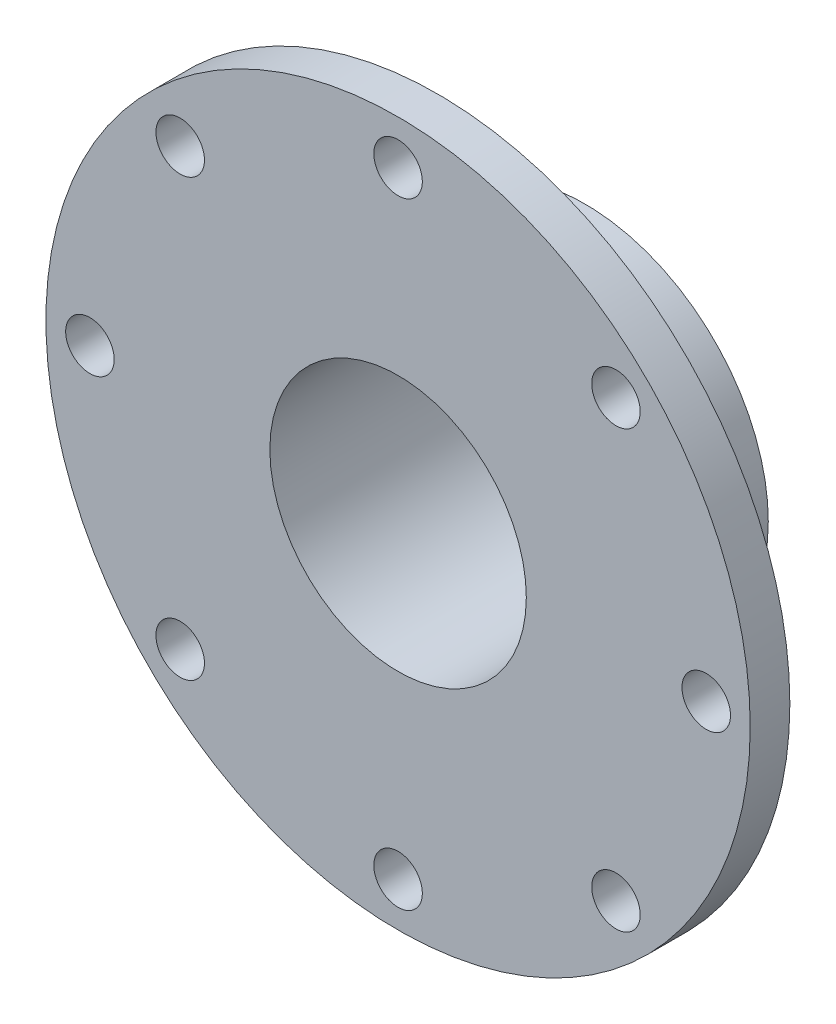
ISO-10303-21;
HEADER;
FILE_DESCRIPTION(('STEP AP214'),'2;1');
FILE_NAME('part.step','',(''),(''),'','','');
FILE_SCHEMA(('AUTOMOTIVE_DESIGN { 1 0 10303 214 1 1 1 1 }'));
ENDSEC;
DATA;
#1=APPLICATION_CONTEXT('core data for automotive mechanical design processes');
#2=APPLICATION_PROTOCOL_DEFINITION('international standard','automotive_design',2000,#1);
#3=PRODUCT_CONTEXT('',#1,'mechanical');
#4=PRODUCT('Part','Part','',(#3));
#5=PRODUCT_RELATED_PRODUCT_CATEGORY('part','',(#4));
#6=PRODUCT_DEFINITION_FORMATION('','',#4);
#7=PRODUCT_DEFINITION_CONTEXT('part definition',#1,'design');
#8=PRODUCT_DEFINITION('design','',#6,#7);
#9=PRODUCT_DEFINITION_SHAPE('','',#8);
#10=(LENGTH_UNIT() NAMED_UNIT(*) SI_UNIT(.MILLI.,.METRE.));
#11=(NAMED_UNIT(*) PLANE_ANGLE_UNIT() SI_UNIT($,.RADIAN.));
#12=(NAMED_UNIT(*) SI_UNIT($,.STERADIAN.) SOLID_ANGLE_UNIT());
#13=UNCERTAINTY_MEASURE_WITH_UNIT(LENGTH_MEASURE(1.E-05),#10,'distance_accuracy_value','');
#14=(GEOMETRIC_REPRESENTATION_CONTEXT(3) GLOBAL_UNCERTAINTY_ASSIGNED_CONTEXT((#13)) GLOBAL_UNIT_ASSIGNED_CONTEXT((#10,
#11,#12)) REPRESENTATION_CONTEXT('',''));
#15=CARTESIAN_POINT('',(0.,0.,0.));
#16=DIRECTION('',(0.,0.,1.));
#17=DIRECTION('',(1.,0.,0.));
#18=AXIS2_PLACEMENT_3D('',#15,#16,#17);
#19=CARTESIAN_POINT('',(0.,26.4566400001054,36.195));
#20=DIRECTION('',(0.,0.,1.));
#21=DIRECTION('',(1.,0.,0.));
#22=AXIS2_PLACEMENT_3D('',#19,#20,#21);
#23=PLANE('',#22);
#24=CARTESIAN_POINT('',(0.,0.,36.195));
#25=DIRECTION('',(0.,0.,1.));
#26=DIRECTION('',(1.,0.,0.));
#27=AXIS2_PLACEMENT_3D('',#24,#25,#26);
#28=CIRCLE('',#27,26.4566400001054);
#29=CARTESIAN_POINT('',(26.4566400001054,0.,36.195));
#30=VERTEX_POINT('',#29);
#31=EDGE_CURVE('E11',#30,#30,#28,.T.);
#32=ORIENTED_EDGE('',*,*,#31,.T.);
#33=EDGE_LOOP('',(#32));
#34=FACE_BOUND('',#33,.T.);
#35=CARTESIAN_POINT('',(0.,0.,36.195));
#36=DIRECTION('',(0.,0.,-1.));
#37=DIRECTION('',(-1.,0.,0.));
#38=AXIS2_PLACEMENT_3D('',#35,#36,#37);
#39=CIRCLE('',#38,35.433);
#40=CARTESIAN_POINT('',(-35.433,0.,36.195));
#41=VERTEX_POINT('',#40);
#42=EDGE_CURVE('E277',#41,#41,#39,.T.);
#43=ORIENTED_EDGE('',*,*,#42,.T.);
#44=EDGE_LOOP('',(#43));
#45=FACE_BOUND('',#44,.T.);
#46=ADVANCED_FACE('F51',(#34,#45),#23,.F.);
#47=CARTESIAN_POINT('',(0.,0.,11.925039552395));
#48=DIRECTION('',(0.,0.,1.));
#49=DIRECTION('',(1.,0.,0.));
#50=AXIS2_PLACEMENT_3D('',#47,#48,#49);
#51=CYLINDRICAL_SURFACE('',#50,26.4566400001054);
#52=ORIENTED_EDGE('',*,*,#31,.F.);
#53=EDGE_LOOP('',(#52));
#54=FACE_BOUND('',#53,.T.);
#55=CARTESIAN_POINT('',(1.97758476261356E-13,-1.78676518025611E-13,14.96296947888));
#56=DIRECTION('',(0.,0.,1.));
#57=DIRECTION('',(1.,0.,0.));
#58=AXIS2_PLACEMENT_3D('',#55,#56,#57);
#59=CIRCLE('',#58,26.4566400001056);
#60=CARTESIAN_POINT('',(17.7258483540588,19.6404709776552,14.96296947888));
#61=VERTEX_POINT('',#60);
#62=CARTESIAN_POINT('',(-17.725848354048,-19.640470977648,14.96296947888));
#63=VERTEX_POINT('',#62);
#64=EDGE_CURVE('E60',#61,#63,#59,.T.);
#65=ORIENTED_EDGE('',*,*,#64,.T.);
#66=CARTESIAN_POINT('',(1.18481613409216E-12,-1.07032438467769E-12,14.96296947888));
#67=DIRECTION('',(0.,0.,1.));
#68=DIRECTION('',(1.,0.,0.));
#69=AXIS2_PLACEMENT_3D('',#66,#67,#68);
#70=CIRCLE('',#69,26.4566400001056);
#71=EDGE_CURVE('E70',#63,#61,#70,.T.);
#72=ORIENTED_EDGE('',*,*,#71,.T.);
#73=EDGE_LOOP('',(#65,#72));
#74=FACE_BOUND('',#73,.T.);
#75=ADVANCED_FACE('F53',(#54,#74),#51,.T.);
#76=CARTESIAN_POINT('',(0.,0.,36.195));
#77=DIRECTION('',(0.,0.,-1.));
#78=DIRECTION('',(-1.,0.,0.));
#79=AXIS2_PLACEMENT_3D('',#76,#77,#78);
#80=CIRCLE('',#79,38.1508);
#81=CARTESIAN_POINT('',(-38.1508,0.,36.195));
#82=VERTEX_POINT('',#81);
#83=EDGE_CURVE('E271',#82,#82,#80,.T.);
#84=ORIENTED_EDGE('',*,*,#83,.F.);
#85=EDGE_LOOP('',(#84));
#86=FACE_BOUND('',#85,.T.);
#87=CARTESIAN_POINT('',(-31.430896423742,-31.430896423742,36.195));
#88=DIRECTION('',(0.,0.,1.));
#89=DIRECTION('',(1.,0.,0.));
#90=AXIS2_PLACEMENT_3D('',#87,#88,#89);
#91=CIRCLE('',#90,3.49999999999999);
#92=CARTESIAN_POINT('',(-27.930896423742,-31.430896423742,36.195));
#93=VERTEX_POINT('',#92);
#94=EDGE_CURVE('E206',#93,#93,#91,.F.);
#95=ORIENTED_EDGE('',*,*,#94,.F.);
#96=EDGE_LOOP('',(#95));
#97=FACE_BOUND('',#96,.T.);
#98=CARTESIAN_POINT('',(31.430896423742,-31.430896423742,36.195));
#99=DIRECTION('',(0.,0.,1.));
#100=DIRECTION('',(1.,0.,0.));
#101=AXIS2_PLACEMENT_3D('',#98,#99,#100);
#102=CIRCLE('',#101,3.49999999999999);
#103=CARTESIAN_POINT('',(34.930896423742,-31.430896423742,36.195));
#104=VERTEX_POINT('',#103);
#105=EDGE_CURVE('E211',#104,#104,#102,.F.);
#106=ORIENTED_EDGE('',*,*,#105,.F.);
#107=EDGE_LOOP('',(#106));
#108=FACE_BOUND('',#107,.T.);
#109=CARTESIAN_POINT('',(31.430896423742,31.430896423742,36.195));
#110=DIRECTION('',(0.,0.,1.));
#111=DIRECTION('',(1.,0.,0.));
#112=AXIS2_PLACEMENT_3D('',#109,#110,#111);
#113=CIRCLE('',#112,3.49999999999999);
#114=CARTESIAN_POINT('',(34.930896423742,31.430896423742,36.195));
#115=VERTEX_POINT('',#114);
#116=EDGE_CURVE('E219',#115,#115,#113,.F.);
#117=ORIENTED_EDGE('',*,*,#116,.F.);
#118=EDGE_LOOP('',(#117));
#119=FACE_BOUND('',#118,.T.);
#120=CARTESIAN_POINT('',(-31.430896423742,31.430896423742,36.195));
#121=DIRECTION('',(0.,0.,1.));
#122=DIRECTION('',(1.,0.,0.));
#123=AXIS2_PLACEMENT_3D('',#120,#121,#122);
#124=CIRCLE('',#123,3.49999999999999);
#125=CARTESIAN_POINT('',(-27.930896423742,31.430896423742,36.195));
#126=VERTEX_POINT('',#125);
#127=EDGE_CURVE('E103',#126,#126,#124,.F.);
#128=ORIENTED_EDGE('',*,*,#127,.F.);
#129=EDGE_LOOP('',(#128));
#130=FACE_BOUND('',#129,.T.);
#131=CARTESIAN_POINT('',(-44.45,0.,36.195));
#132=DIRECTION('',(0.,0.,1.));
#133=DIRECTION('',(1.,0.,0.));
#134=AXIS2_PLACEMENT_3D('',#131,#132,#133);
#135=CIRCLE('',#134,3.49999999999999);
#136=CARTESIAN_POINT('',(-40.95,0.,36.195));
#137=VERTEX_POINT('',#136);
#138=EDGE_CURVE('E100',#137,#137,#135,.F.);
#139=ORIENTED_EDGE('',*,*,#138,.F.);
#140=EDGE_LOOP('',(#139));
#141=FACE_BOUND('',#140,.T.);
#142=CARTESIAN_POINT('',(0.,44.45,36.195));
#143=DIRECTION('',(0.,0.,1.));
#144=DIRECTION('',(1.,0.,0.));
#145=AXIS2_PLACEMENT_3D('',#142,#143,#144);
#146=CIRCLE('',#145,3.49999999999999);
#147=CARTESIAN_POINT('',(3.49999999999999,44.45,36.195));
#148=VERTEX_POINT('',#147);
#149=EDGE_CURVE('E222',#148,#148,#146,.F.);
#150=ORIENTED_EDGE('',*,*,#149,.F.);
#151=EDGE_LOOP('',(#150));
#152=FACE_BOUND('',#151,.T.);
#153=CARTESIAN_POINT('',(44.45,0.,36.195));
#154=DIRECTION('',(0.,0.,1.));
#155=DIRECTION('',(1.,0.,0.));
#156=AXIS2_PLACEMENT_3D('',#153,#154,#155);
#157=CIRCLE('',#156,3.49999999999999);
#158=CARTESIAN_POINT('',(47.95,0.,36.195));
#159=VERTEX_POINT('',#158);
#160=EDGE_CURVE('E216',#159,#159,#157,.F.);
#161=ORIENTED_EDGE('',*,*,#160,.F.);
#162=EDGE_LOOP('',(#161));
#163=FACE_BOUND('',#162,.T.);
#164=CARTESIAN_POINT('',(0.,-44.45,36.195));
#165=DIRECTION('',(0.,0.,1.));
#166=DIRECTION('',(1.,0.,0.));
#167=AXIS2_PLACEMENT_3D('',#164,#165,#166);
#168=CIRCLE('',#167,3.49999999999999);
#169=CARTESIAN_POINT('',(3.5,-44.45,36.195));
#170=VERTEX_POINT('',#169);
#171=EDGE_CURVE('E208',#170,#170,#168,.F.);
#172=ORIENTED_EDGE('',*,*,#171,.F.);
#173=EDGE_LOOP('',(#172));
#174=FACE_BOUND('',#173,.T.);
#175=CARTESIAN_POINT('',(0.,0.,36.195));
#176=DIRECTION('',(0.,0.,1.));
#177=DIRECTION('',(1.,0.,0.));
#178=AXIS2_PLACEMENT_3D('',#175,#176,#177);
#179=CIRCLE('',#178,50.8);
#180=CARTESIAN_POINT('',(50.8,0.,36.195));
#181=VERTEX_POINT('',#180);
#182=EDGE_CURVE('E55',#181,#181,#179,.T.);
#183=ORIENTED_EDGE('',*,*,#182,.F.);
#184=EDGE_LOOP('',(#183));
#185=FACE_BOUND('',#184,.T.);
#186=ADVANCED_FACE('F122',(#86,#97,#108,#119,#130,#141,#152,#163,#174,#185),#23,.F.);
#187=CARTESIAN_POINT('',(-4.084296855774,-4.5254541423168,14.96296947888));
#188=CARTESIAN_POINT('',(-13.1352051404076,3.6431395692312,14.96296947888));
#189=CARTESIAN_POINT('',(-4.9666114288596,12.6940478538648,14.96296947888));
#190=CARTESIAN_POINT('',(4.084296855774,4.5254541423168,14.96296947888));
#191=CARTESIAN_POINT('',(13.1352051404076,-3.6431395692312,14.96296947888));
#192=CARTESIAN_POINT('',(4.9666114288596,-12.6940478538648,14.96296947888));
#193=CARTESIAN_POINT('',(-4.084296855774,-4.5254541423168,14.96296947888));
#194=CARTESIAN_POINT('',(-17.725848354048,-19.640470977648,14.96296947888));
#195=CARTESIAN_POINT('',(-57.006790309344,15.811225730448,14.96296947888));
#196=CARTESIAN_POINT('',(-21.555093601248,55.092167685744,14.96296947888));
#197=CARTESIAN_POINT('',(17.725848354048,19.640470977648,14.96296947888));
#198=CARTESIAN_POINT('',(57.006790309344,-15.811225730448,14.96296947888));
#199=CARTESIAN_POINT('',(21.555093601248,-55.092167685744,14.96296947888));
#200=CARTESIAN_POINT('',(-17.725848354048,-19.640470977648,14.96296947888));
#201=(BOUNDED_SURFACE() B_SPLINE_SURFACE(1,3,((#187,#188,#189,#190,#191,#192,#193),(#194,#195,
#196,#197,#198,#199,#200)),.UNSPECIFIED.,.F.,.T.,.F.) B_SPLINE_SURFACE_WITH_KNOTS((2,2),(4,3,4),
(0.,1.),(0.,0.5,1.),
.UNSPECIFIED.) GEOMETRIC_REPRESENTATION_ITEM() RATIONAL_B_SPLINE_SURFACE(((1.,0.333333333333333,
0.333333333333333,1.,0.333333333333333,0.333333333333333,1.),(1.,0.333333333333333,
0.333333333333333,1.,0.333333333333333,0.333333333333333,1.))) REPRESENTATION_ITEM('') SURFACE());
#202=CARTESIAN_POINT('',(-12.3949297335764,-13.7337436742028,14.96296947888));
#203=CARTESIAN_POINT('',(-12.1374248361536,-13.9661609277359,14.96296947888));
#204=CARTESIAN_POINT('',(-11.8733697517605,-14.1913186237609,14.96296947888));
#205=CARTESIAN_POINT('',(-11.3330374871853,-14.6264303637532,14.96296947888));
#206=CARTESIAN_POINT('',(-11.0567608869363,-14.8363851278832,14.96296947888));
#207=CARTESIAN_POINT('',(-10.4928439411871,-15.2404252978761,14.96296947888));
#208=CARTESIAN_POINT('',(-10.2052037831083,-15.434510965309,14.96296947888));
#209=CARTESIAN_POINT('',(-9.6196733956169,-15.8060754336181,14.96296947888));
#210=CARTESIAN_POINT('',(-9.32179045512875,-15.9835657226864,14.96296947888));
#211=CARTESIAN_POINT('',(-8.71652215301953,-16.3215309632389,14.96296947888));
#212=CARTESIAN_POINT('',(-8.40913689197121,-16.4820060947322,14.96296947888));
#213=CARTESIAN_POINT('',(-7.78585631044147,-16.7854282639548,14.96296947888));
#214=CARTESIAN_POINT('',(-7.46996103790707,-16.9283754004148,14.96296947888));
#215=CARTESIAN_POINT('',(-6.67060903726668,-17.2633530303692,14.96296947888));
#216=CARTESIAN_POINT('',(-6.18239926776938,-17.4441543386045,14.96296947888));
#217=CARTESIAN_POINT('',(-5.19239544561059,-17.7639986783432,14.96296947888));
#218=CARTESIAN_POINT('',(-4.69059961233225,-17.9030362070376,14.96296947888));
#219=CARTESIAN_POINT('',(-3.93060830828274,-18.0794913812778,14.96296947888));
#220=CARTESIAN_POINT('',(-3.67604833828949,-18.1329615100464,14.96296947888));
#221=CARTESIAN_POINT('',(-3.16497413439273,-18.2291122092523,14.96296947888));
#222=CARTESIAN_POINT('',(-2.90846047120277,-18.2717958148488,14.96296947888));
#223=CARTESIAN_POINT('',(-2.13651113292315,-18.3835683545609,14.96296947888));
#224=CARTESIAN_POINT('',(-1.6186234389262,-18.4363891452061,14.96296947888));
#225=CARTESIAN_POINT('',(-0.580294820050416,-18.4982118697073,14.96296947888));
#226=CARTESIAN_POINT('',(-0.0598538354970048,-18.5072127744903,14.96296947888));
#227=CARTESIAN_POINT('',(0.97995564099335,-18.4813450008999,14.96296947888));
#228=CARTESIAN_POINT('',(1.49932413104242,-18.4464762453701,14.96296947888));
#229=CARTESIAN_POINT('',(2.53335173559417,-18.3331039452942,14.96296947888));
#230=CARTESIAN_POINT('',(3.04801012272939,-18.2545937731627,14.96296947888));
#231=CARTESIAN_POINT('',(4.06888383811144,-18.0544934363245,14.96296947888));
#232=CARTESIAN_POINT('',(4.57509917011917,-17.9329032908081,14.96296947888));
#233=CARTESIAN_POINT('',(5.5754639154929,-17.6475135516263,14.96296947888));
#234=CARTESIAN_POINT('',(6.06961385912722,-17.4837158166341,14.96296947888));
#235=CARTESIAN_POINT('',(7.04235807292921,-17.1150729727002,14.96296947888));
#236=CARTESIAN_POINT('',(7.52095234222813,-16.910227861466,14.96296947888));
#237=CARTESIAN_POINT('',(8.45915221755046,-16.4609610879201,14.96296947888));
#238=CARTESIAN_POINT('',(8.91875903854748,-16.2165419628188,14.96296947888));
#239=CARTESIAN_POINT('',(9.81574923107665,-15.6898554134345,14.96296947888));
#240=CARTESIAN_POINT('',(10.2531326041715,-15.4075879918129,14.96296947888));
#241=CARTESIAN_POINT('',(11.1025753148572,-14.8072052875271,14.96296947888));
#242=CARTESIAN_POINT('',(11.5146341322074,-14.4890892688077,14.96296947888));
#243=CARTESIAN_POINT('',(12.3104885578065,-13.8192756158299,14.96296947888));
#244=CARTESIAN_POINT('',(12.6942841644973,-13.46757797972,14.96296947888));
#245=CARTESIAN_POINT('',(13.4308921370195,-12.7330929439569,14.96296947888));
#246=CARTESIAN_POINT('',(13.7837037896113,-12.3503048290021,14.96296947888));
#247=CARTESIAN_POINT('',(14.4558256029332,-11.5563673217514,14.96296947888));
#248=CARTESIAN_POINT('',(14.7751357636354,-11.1452179294319,14.96296947888));
#249=CARTESIAN_POINT('',(15.3779814435576,-10.2974851726799,14.96296947888));
#250=CARTESIAN_POINT('',(15.661517317967,-9.86090206083209,14.96296947888));
#251=CARTESIAN_POINT('',(16.1908023545749,-8.96540201389805,14.96296947888));
#252=CARTESIAN_POINT('',(16.4365515169635,-8.5064850789242,14.96296947888));
#253=CARTESIAN_POINT('',(16.8885152823833,-7.5695814939373,14.96296947888));
#254=CARTESIAN_POINT('',(17.0947300099331,-7.09159490399219,14.96296947888));
#255=CARTESIAN_POINT('',(17.4661598017411,-6.11994887640352,14.96296947888));
#256=CARTESIAN_POINT('',(17.6313748681229,-5.62628943957173,14.96296947888));
#257=CARTESIAN_POINT('',(17.9196345272205,-4.62679422381347,14.96296947888));
#258=CARTESIAN_POINT('',(18.0426780195985,-4.1209581275429,14.96296947888));
#259=CARTESIAN_POINT('',(18.2457138354231,-3.1007182853412,14.96296947888));
#260=CARTESIAN_POINT('',(18.3257061422653,-2.58631453610567,14.96296947888));
#261=CARTESIAN_POINT('',(18.4420678098729,-1.55262158822211,14.96296947888));
#262=CARTESIAN_POINT('',(18.4784392897828,-1.03333262813798,14.96296947888));
#263=CARTESIAN_POINT('',(18.5073083537656,0.00646122249011968,14.96296947888));
#264=CARTESIAN_POINT('',(18.4998060206987,0.526966110735824,14.96296947888));
#265=CARTESIAN_POINT('',(18.4409828853628,1.56542693147615,14.96296947888));
#266=CARTESIAN_POINT('',(18.3896681018976,2.08338320426123,14.96296947888));
#267=CARTESIAN_POINT('',(18.2436002519494,3.11311978829642,14.96296947888));
#268=CARTESIAN_POINT('',(18.1488468587696,3.62490005306774,14.96296947888));
#269=CARTESIAN_POINT('',(17.9165067988456,4.6388920035565,14.96296947888));
#270=CARTESIAN_POINT('',(17.7789060100946,5.14110047652482,14.96296947888));
#271=CARTESIAN_POINT('',(17.5412002030789,5.88421572052534,14.96296947888));
#272=CARTESIAN_POINT('',(17.4567443391086,6.13022882312632,14.96296947888));
#273=CARTESIAN_POINT('',(17.2775161205007,6.61854146903375,14.96296947888));
#274=CARTESIAN_POINT('',(17.1827411134035,6.86084003920208,14.96296947888));
#275=CARTESIAN_POINT('',(16.8831189371849,7.58162634015181,14.96296947888));
#276=CARTESIAN_POINT('',(16.6630184790492,8.0538675748988,14.96296947888));
#277=CARTESIAN_POINT('',(16.1837774259604,8.97810214121516,14.96296947888));
#278=CARTESIAN_POINT('',(15.9246370675557,9.43009559544719,14.96296947888));
#279=CARTESIAN_POINT('',(15.5082730113219,10.0901482140572,14.96296947888));
#280=CARTESIAN_POINT('',(15.364950542304,10.3070775874979,14.96296947888));
#281=CARTESIAN_POINT('',(15.0693335859105,10.7346510305783,14.96296947888));
#282=CARTESIAN_POINT('',(14.9170412301534,10.9452965757353,14.96296947888));
#283=CARTESIAN_POINT('',(14.4471561834382,11.5671696285765,14.96296947888));
#284=CARTESIAN_POINT('',(14.116389920537,11.9685959939125,14.96296947888));
#285=CARTESIAN_POINT('',(13.5524355060581,12.5971088611518,14.96296947888));
#286=CARTESIAN_POINT('',(13.3291191401865,12.8331646799489,14.96296947888));
#287=CARTESIAN_POINT('',(12.8707507553507,13.2928149462942,14.96296947888));
#288=CARTESIAN_POINT('',(12.6357187475473,13.5164293492994,14.96296947888));
#289=CARTESIAN_POINT('',(12.3949297335764,13.7337436742028,14.96296947888));
#290=B_SPLINE_CURVE_WITH_KNOTS('',3,(#202,#203,#204,#205,#206,#207,#208,#209,#210,#211,#212,
#213,#214,#215,#216,#217,#218,#219,#220,#221,#222,#223,#224,#225,#226,#227,#228,#229,#230,#231,
#232,#233,#234,#235,#236,#237,#238,#239,#240,#241,#242,#243,#244,#245,#246,#247,#248,#249,#250,
#251,#252,#253,#254,#255,#256,#257,#258,#259,#260,#261,#262,#263,#264,#265,#266,#267,#268,#269,
#270,#271,#272,#273,#274,#275,#276,#277,#278,#279,#280,#281,#282,#283,#284,#285,#286,#287,#288,
#289),.UNSPECIFIED.,.F.,.F.,(4,2,2,2,2,2,2,2,2,2,2,2,2,2,2,2,2,2,2,2,2,2,2,2,2,2,2,2,2,2,2,2,2,
2,2,2,2,2,2,2,2,2,2,4),(0.,1.04050418783333,2.08095905471282,3.12139676833694,4.16110881954517,
5.20080987018595,6.24050506417908,7.80042513477577,9.36055065087042,10.1406936378467,
10.9206168597197,12.4803292436483,14.0400782559311,15.5998300114523,17.159818702753,
18.7198066991447,20.2797260109126,21.8396454097983,23.3994648370749,24.9592841546678,
26.5191355048201,28.0789869409667,29.6388742749306,31.1987616101958,32.7586334567087,
34.3185052953701,35.8783722209441,37.4382390657245,38.9981466073483,40.5580547506154,
42.1178871088811,43.6777165212499,45.2373316840915,46.7969585768166,48.3571000496167,
49.1372200002809,49.9175409505485,51.4786132476123,53.0396760862981,53.819468679672,
54.5990767037428,56.1573646830149,57.1318172049753,58.1046588057994),.UNSPECIFIED.);
#291=CARTESIAN_POINT('',(-12.3949297335764,-13.7337436742028,14.96296947888));
#292=VERTEX_POINT('',#291);
#293=CARTESIAN_POINT('',(12.394929733578,13.7337436742013,14.96296947888));
#294=VERTEX_POINT('',#293);
#295=EDGE_CURVE('E93',#292,#294,#290,.T.);
#296=CARTESIAN_POINT('',(4.084296855774,4.5254541423168,14.96296947888));
#297=CARTESIAN_POINT('',(17.7258483540588,19.6404709776552,14.96296947888));
#298=(BOUNDED_CURVE() B_SPLINE_CURVE(1,(#296,#297),.UNSPECIFIED.,.F.,
.F.) B_SPLINE_CURVE_WITH_KNOTS((2,2),(0.,1.),
.UNSPECIFIED.) CURVE() GEOMETRIC_REPRESENTATION_ITEM() RATIONAL_B_SPLINE_CURVE((1.,1.)) REPRESENTATION_ITEM(''));
#299=EDGE_CURVE('E89',#294,#61,#298,.T.);
#300=CARTESIAN_POINT('',(-4.084296855774,-4.5254541423168,14.96296947888));
#301=CARTESIAN_POINT('',(-17.725848354048,-19.640470977648,14.96296947888));
#302=(BOUNDED_CURVE() B_SPLINE_CURVE(1,(#300,#301),.UNSPECIFIED.,.F.,
.F.) B_SPLINE_CURVE_WITH_KNOTS((2,2),(0.,1.),
.UNSPECIFIED.) CURVE() GEOMETRIC_REPRESENTATION_ITEM() RATIONAL_B_SPLINE_CURVE((1.,1.)) REPRESENTATION_ITEM(''));
#303=EDGE_CURVE('E88',#292,#63,#302,.T.);
#304=ORIENTED_EDGE('',*,*,#295,.T.);
#305=ORIENTED_EDGE('',*,*,#299,.T.);
#306=ORIENTED_EDGE('',*,*,#71,.F.);
#307=ORIENTED_EDGE('',*,*,#303,.F.);
#308=EDGE_LOOP('',(#304,#305,#306,#307));
#309=FACE_BOUND('',#308,.T.);
#310=ADVANCED_FACE('F95',(#309),#201,.T.);
#311=CARTESIAN_POINT('',(0.,0.,-18.42770000007));
#312=DIRECTION('',(0.,0.,1.));
#313=DIRECTION('',(1.,0.,0.));
#314=AXIS2_PLACEMENT_3D('',#311,#312,#313);
#315=CYLINDRICAL_SURFACE('',#314,18.499999957);
#316=ORIENTED_EDGE('',*,*,#295,.F.);
#317=CARTESIAN_POINT('',(12.394929733578,13.7337436742013,14.96296947888));
#318=CARTESIAN_POINT('',(12.1374248361553,13.9661609277344,14.96296947888));
#319=CARTESIAN_POINT('',(11.8733697517622,14.1913186237594,14.96296947888));
#320=CARTESIAN_POINT('',(11.3330374871871,14.6264303637519,14.96296947888));
#321=CARTESIAN_POINT('',(11.0567608869381,14.8363851278819,14.96296947888));
#322=CARTESIAN_POINT('',(10.492843941189,15.2404252978749,14.96296947888));
#323=CARTESIAN_POINT('',(10.2052037831101,15.4345109653078,14.96296947888));
#324=CARTESIAN_POINT('',(9.61967339561879,15.806075433617,14.96296947888));
#325=CARTESIAN_POINT('',(9.32179045513067,15.9835657226853,14.96296947888));
#326=CARTESIAN_POINT('',(8.71652215302149,16.3215309632378,14.96296947888));
#327=CARTESIAN_POINT('',(8.40913689197318,16.4820060947312,14.96296947888));
#328=CARTESIAN_POINT('',(7.78585631044348,16.7854282639538,14.96296947888));
#329=CARTESIAN_POINT('',(7.46996103790909,16.9283754004139,14.96296947888));
#330=CARTESIAN_POINT('',(6.67060903726874,17.2633530303684,14.96296947888));
#331=CARTESIAN_POINT('',(6.18239926777146,17.4441543386038,14.96296947888));
#332=CARTESIAN_POINT('',(5.19239544561271,17.7639986783426,14.96296947888));
#333=CARTESIAN_POINT('',(4.69059961233438,17.903036207037,14.96296947888));
#334=CARTESIAN_POINT('',(3.93060830828489,18.0794913812773,14.96296947888));
#335=CARTESIAN_POINT('',(3.67604833829165,18.1329615100459,14.96296947888));
#336=CARTESIAN_POINT('',(3.1649741343949,18.2291122092519,14.96296947888));
#337=CARTESIAN_POINT('',(2.90846047120494,18.2717958148485,14.96296947888));
#338=CARTESIAN_POINT('',(2.13651113292534,18.3835683545606,14.96296947888));
#339=CARTESIAN_POINT('',(1.61862343892839,18.4363891452059,14.96296947888));
#340=CARTESIAN_POINT('',(0.580294820052612,18.4982118697072,14.96296947888));
#341=CARTESIAN_POINT('',(0.0598538354992006,18.5072127744903,14.96296947888));
#342=CARTESIAN_POINT('',(-0.979955640991158,18.4813450009,14.96296947888));
#343=CARTESIAN_POINT('',(-1.49932413104023,18.4464762453703,14.96296947888));
#344=CARTESIAN_POINT('',(-2.533351735592,18.3331039452945,14.96296947888));
#345=CARTESIAN_POINT('',(-3.04801012272723,18.2545937731631,14.96296947888));
#346=CARTESIAN_POINT('',(-4.0688838381093,18.054493436325,14.96296947888));
#347=CARTESIAN_POINT('',(-4.57509917011705,17.9329032908086,14.96296947888));
#348=CARTESIAN_POINT('',(-5.57546391549081,17.6475135516269,14.96296947888));
#349=CARTESIAN_POINT('',(-6.06961385912515,17.4837158166348,14.96296947888));
#350=CARTESIAN_POINT('',(-7.04235807292718,17.115072972701,14.96296947888));
#351=CARTESIAN_POINT('',(-7.52095234222613,16.9102278614669,14.96296947888));
#352=CARTESIAN_POINT('',(-8.45915221754851,16.4609610879211,14.96296947888));
#353=CARTESIAN_POINT('',(-8.91875903854556,16.2165419628199,14.96296947888));
#354=CARTESIAN_POINT('',(-9.81574923107478,15.6898554134357,14.96296947888));
#355=CARTESIAN_POINT('',(-10.2531326041697,15.4075879918141,14.96296947888));
#356=CARTESIAN_POINT('',(-11.1025753148554,14.8072052875284,14.96296947888));
#357=CARTESIAN_POINT('',(-11.5146341322057,14.4890892688091,14.96296947888));
#358=CARTESIAN_POINT('',(-12.3104885578049,13.8192756158313,14.96296947888));
#359=CARTESIAN_POINT('',(-12.6942841644957,13.4675779797215,14.96296947888));
#360=CARTESIAN_POINT('',(-13.430892137018,12.7330929439585,14.96296947888));
#361=CARTESIAN_POINT('',(-13.7837037896099,12.3503048290037,14.96296947888));
#362=CARTESIAN_POINT('',(-14.4558256029318,11.5563673217531,14.96296947888));
#363=CARTESIAN_POINT('',(-14.775135763634,11.1452179294336,14.96296947888));
#364=CARTESIAN_POINT('',(-15.3779814435563,10.2974851726817,14.96296947888));
#365=CARTESIAN_POINT('',(-15.6615173179658,9.86090206083394,14.96296947888));
#366=CARTESIAN_POINT('',(-16.1908023545738,8.96540201389996,14.96296947888));
#367=CARTESIAN_POINT('',(-16.4365515169625,8.50648507892614,14.96296947888));
#368=CARTESIAN_POINT('',(-16.8885152823824,7.5695814939393,14.96296947888));
#369=CARTESIAN_POINT('',(-17.0947300099323,7.09159490399421,14.96296947888));
#370=CARTESIAN_POINT('',(-17.4661598017404,6.11994887640558,14.96296947888));
#371=CARTESIAN_POINT('',(-17.6313748681223,5.62628943957382,14.96296947888));
#372=CARTESIAN_POINT('',(-17.91963452722,4.62679422381559,14.96296947888));
#373=CARTESIAN_POINT('',(-18.042678019598,4.12095812754504,14.96296947888));
#374=CARTESIAN_POINT('',(-18.2457138354227,3.10071828534335,14.96296947888));
#375=CARTESIAN_POINT('',(-18.325706142265,2.58631453610784,14.96296947888));
#376=CARTESIAN_POINT('',(-18.4420678098728,1.5526215882243,14.96296947888));
#377=CARTESIAN_POINT('',(-18.4784392897826,1.03333262814017,14.96296947888));
#378=CARTESIAN_POINT('',(-18.5073083537656,-0.00646122248792655,14.96296947888));
#379=CARTESIAN_POINT('',(-18.4998060206988,-0.526966110733632,14.96296947888));
#380=CARTESIAN_POINT('',(-18.440982885363,-1.56542693147396,14.96296947888));
#381=CARTESIAN_POINT('',(-18.3896681018979,-2.08338320425905,14.96296947888));
#382=CARTESIAN_POINT('',(-18.2436002519498,-3.11311978829425,14.96296947888));
#383=CARTESIAN_POINT('',(-18.14884685877,-3.62490005306559,14.96296947888));
#384=CARTESIAN_POINT('',(-17.9165067988462,-4.63889200355438,14.96296947888));
#385=CARTESIAN_POINT('',(-17.7789060100952,-5.14110047652271,14.96296947888));
#386=CARTESIAN_POINT('',(-17.5412002030796,-5.88421572052326,14.96296947888));
#387=CARTESIAN_POINT('',(-17.4567443391093,-6.13022882312424,14.96296947888));
#388=CARTESIAN_POINT('',(-17.2775161205015,-6.61854146903171,14.96296947888));
#389=CARTESIAN_POINT('',(-17.1827411134043,-6.86084003920005,14.96296947888));
#390=CARTESIAN_POINT('',(-16.8831189371859,-7.58162634014981,14.96296947888));
#391=CARTESIAN_POINT('',(-16.6630184790501,-8.05386757489682,14.96296947888));
#392=CARTESIAN_POINT('',(-16.1837774259615,-8.97810214121324,14.96296947888));
#393=CARTESIAN_POINT('',(-15.9246370675568,-9.4300955954453,14.96296947888));
#394=CARTESIAN_POINT('',(-15.5082730113231,-10.0901482140554,14.96296947888));
#395=CARTESIAN_POINT('',(-15.3649505423052,-10.3070775874961,14.96296947888));
#396=CARTESIAN_POINT('',(-15.0693335859118,-10.7346510305766,14.96296947888));
#397=CARTESIAN_POINT('',(-14.9170412301547,-10.9452965757335,14.96296947888));
#398=CARTESIAN_POINT('',(-14.4471561834396,-11.5671696285748,14.96296947888));
#399=CARTESIAN_POINT('',(-14.1163899205384,-11.9685959939108,14.96296947888));
#400=CARTESIAN_POINT('',(-13.5524355060593,-12.5971088611505,14.96296947888));
#401=CARTESIAN_POINT('',(-13.3291191401875,-12.8331646799479,14.96296947888));
#402=CARTESIAN_POINT('',(-12.8707507553513,-13.2928149462937,14.96296947888));
#403=CARTESIAN_POINT('',(-12.6357187475476,-13.5164293492992,14.96296947888));
#404=CARTESIAN_POINT('',(-12.3949297335764,-13.7337436742028,14.96296947888));
#405=B_SPLINE_CURVE_WITH_KNOTS('',3,(#317,#318,#319,#320,#321,#322,#323,#324,#325,#326,#327,
#328,#329,#330,#331,#332,#333,#334,#335,#336,#337,#338,#339,#340,#341,#342,#343,#344,#345,#346,
#347,#348,#349,#350,#351,#352,#353,#354,#355,#356,#357,#358,#359,#360,#361,#362,#363,#364,#365,
#366,#367,#368,#369,#370,#371,#372,#373,#374,#375,#376,#377,#378,#379,#380,#381,#382,#383,#384,
#385,#386,#387,#388,#389,#390,#391,#392,#393,#394,#395,#396,#397,#398,#399,#400,#401,#402,#403,
#404),.UNSPECIFIED.,.F.,.F.,(4,2,2,2,2,2,2,2,2,2,2,2,2,2,2,2,2,2,2,2,2,2,2,2,2,2,2,2,2,2,2,2,2,
2,2,2,2,2,2,2,2,2,2,4),(0.,1.04050418783333,2.08095905471283,3.12139676833694,4.16110881954518,
5.20080987018596,6.2405050641791,7.80042513477579,9.36055065087045,10.1406936378467,
10.9206168597198,12.4803292436483,14.0400782559312,15.5998300114523,17.159818702753,
18.7198066991448,20.2797260109126,21.8396454097983,23.3994648370749,24.9592841546678,
26.5191355048201,28.0789869409667,29.6388742749306,31.1987616101958,32.7586334567088,
34.3185052953701,35.8783722209442,37.4382390657246,38.9981466073484,40.5580547506154,
42.1178871088811,43.6777165212499,45.2373316840915,46.7969585768166,48.3571000496167,
49.1372200002809,49.9175409505485,51.4786132476124,53.0396760862981,53.819468679672,
54.5990767037429,56.1573646830149,57.1318172049764,58.1046588058016),.UNSPECIFIED.);
#406=EDGE_CURVE('E86',#294,#292,#405,.T.);
#407=ORIENTED_EDGE('',*,*,#406,.F.);
#408=EDGE_LOOP('',(#316,#407));
#409=FACE_BOUND('',#408,.T.);
#410=CARTESIAN_POINT('',(0.,0.,41.91));
#411=DIRECTION('',(0.,0.,1.));
#412=DIRECTION('',(1.,0.,0.));
#413=AXIS2_PLACEMENT_3D('',#410,#411,#412);
#414=CIRCLE('',#413,18.499999957);
#415=CARTESIAN_POINT('',(18.499999957,0.,41.91));
#416=VERTEX_POINT('',#415);
#417=EDGE_CURVE('E181',#416,#416,#414,.T.);
#418=ORIENTED_EDGE('',*,*,#417,.T.);
#419=EDGE_LOOP('',(#418));
#420=FACE_BOUND('',#419,.T.);
#421=ADVANCED_FACE('F98',(#409,#420),#315,.F.);
#422=CARTESIAN_POINT('',(-4.084296855774,-4.5254541423168,14.96296947888));
#423=CARTESIAN_POINT('',(-13.1352051404076,3.6431395692312,14.96296947888));
#424=CARTESIAN_POINT('',(-4.9666114288596,12.6940478538648,14.96296947888));
#425=CARTESIAN_POINT('',(4.084296855774,4.5254541423168,14.96296947888));
#426=CARTESIAN_POINT('',(13.1352051404076,-3.6431395692312,14.96296947888));
#427=CARTESIAN_POINT('',(4.9666114288596,-12.6940478538648,14.96296947888));
#428=CARTESIAN_POINT('',(-4.084296855774,-4.5254541423168,14.96296947888));
#429=CARTESIAN_POINT('',(-17.725848354048,-19.640470977648,14.96296947888));
#430=CARTESIAN_POINT('',(-57.006790309344,15.811225730448,14.96296947888));
#431=CARTESIAN_POINT('',(-21.555093601248,55.092167685744,14.96296947888));
#432=CARTESIAN_POINT('',(17.725848354048,19.640470977648,14.96296947888));
#433=CARTESIAN_POINT('',(57.006790309344,-15.811225730448,14.96296947888));
#434=CARTESIAN_POINT('',(21.555093601248,-55.092167685744,14.96296947888));
#435=CARTESIAN_POINT('',(-17.725848354048,-19.640470977648,14.96296947888));
#436=(BOUNDED_SURFACE() B_SPLINE_SURFACE(1,3,((#422,#423,#424,#425,#426,#427,#428),(#429,#430,
#431,#432,#433,#434,#435)),.UNSPECIFIED.,.F.,.T.,.F.) B_SPLINE_SURFACE_WITH_KNOTS((2,2),(4,3,4),
(0.,1.),(0.,0.5,1.),
.UNSPECIFIED.) GEOMETRIC_REPRESENTATION_ITEM() RATIONAL_B_SPLINE_SURFACE(((1.,0.333333333333333,
0.333333333333333,1.,0.333333333333333,0.333333333333333,1.),(1.,0.333333333333333,
0.333333333333333,1.,0.333333333333333,0.333333333333333,1.))) REPRESENTATION_ITEM('') SURFACE());
#437=ORIENTED_EDGE('',*,*,#406,.T.);
#438=ORIENTED_EDGE('',*,*,#303,.T.);
#439=ORIENTED_EDGE('',*,*,#64,.F.);
#440=ORIENTED_EDGE('',*,*,#299,.F.);
#441=EDGE_LOOP('',(#437,#438,#439,#440));
#442=FACE_BOUND('',#441,.T.);
#443=ADVANCED_FACE('F87',(#442),#436,.T.);
#444=CARTESIAN_POINT('',(0.,0.,41.91));
#445=DIRECTION('',(0.,0.,1.));
#446=DIRECTION('',(1.,0.,0.));
#447=AXIS2_PLACEMENT_3D('',#444,#445,#446);
#448=PLANE('',#447);
#449=CARTESIAN_POINT('',(-44.45,0.,41.91));
#450=DIRECTION('',(0.,0.,1.));
#451=DIRECTION('',(1.,0.,0.));
#452=AXIS2_PLACEMENT_3D('',#449,#450,#451);
#453=CIRCLE('',#452,3.49999999999999);
#454=CARTESIAN_POINT('',(-40.95,0.,41.91));
#455=VERTEX_POINT('',#454);
#456=EDGE_CURVE('E267',#455,#455,#453,.T.);
#457=ORIENTED_EDGE('',*,*,#456,.F.);
#458=EDGE_LOOP('',(#457));
#459=FACE_BOUND('',#458,.T.);
#460=CARTESIAN_POINT('',(-31.430896423742,31.430896423742,41.91));
#461=DIRECTION('',(0.,0.,1.));
#462=DIRECTION('',(1.,0.,0.));
#463=AXIS2_PLACEMENT_3D('',#460,#461,#462);
#464=CIRCLE('',#463,3.49999999999999);
#465=CARTESIAN_POINT('',(-27.930896423742,31.430896423742,41.91));
#466=VERTEX_POINT('',#465);
#467=EDGE_CURVE('E264',#466,#466,#464,.T.);
#468=ORIENTED_EDGE('',*,*,#467,.F.);
#469=EDGE_LOOP('',(#468));
#470=FACE_BOUND('',#469,.T.);
#471=CARTESIAN_POINT('',(0.,44.45,41.91));
#472=DIRECTION('',(0.,0.,1.));
#473=DIRECTION('',(1.,0.,0.));
#474=AXIS2_PLACEMENT_3D('',#471,#472,#473);
#475=CIRCLE('',#474,3.49999999999999);
#476=CARTESIAN_POINT('',(3.49999999999999,44.45,41.91));
#477=VERTEX_POINT('',#476);
#478=EDGE_CURVE('E261',#477,#477,#475,.T.);
#479=ORIENTED_EDGE('',*,*,#478,.F.);
#480=EDGE_LOOP('',(#479));
#481=FACE_BOUND('',#480,.T.);
#482=CARTESIAN_POINT('',(31.430896423742,31.430896423742,41.91));
#483=DIRECTION('',(0.,0.,1.));
#484=DIRECTION('',(1.,0.,0.));
#485=AXIS2_PLACEMENT_3D('',#482,#483,#484);
#486=CIRCLE('',#485,3.49999999999999);
#487=CARTESIAN_POINT('',(34.930896423742,31.430896423742,41.91));
#488=VERTEX_POINT('',#487);
#489=EDGE_CURVE('E258',#488,#488,#486,.T.);
#490=ORIENTED_EDGE('',*,*,#489,.F.);
#491=EDGE_LOOP('',(#490));
#492=FACE_BOUND('',#491,.T.);
#493=CARTESIAN_POINT('',(44.45,0.,41.91));
#494=DIRECTION('',(0.,0.,1.));
#495=DIRECTION('',(1.,0.,0.));
#496=AXIS2_PLACEMENT_3D('',#493,#494,#495);
#497=CIRCLE('',#496,3.49999999999999);
#498=CARTESIAN_POINT('',(47.95,0.,41.91));
#499=VERTEX_POINT('',#498);
#500=EDGE_CURVE('E253',#499,#499,#497,.T.);
#501=ORIENTED_EDGE('',*,*,#500,.F.);
#502=EDGE_LOOP('',(#501));
#503=FACE_BOUND('',#502,.T.);
#504=CARTESIAN_POINT('',(31.430896423742,-31.430896423742,41.91));
#505=DIRECTION('',(0.,0.,1.));
#506=DIRECTION('',(1.,0.,0.));
#507=AXIS2_PLACEMENT_3D('',#504,#505,#506);
#508=CIRCLE('',#507,3.49999999999999);
#509=CARTESIAN_POINT('',(34.930896423742,-31.430896423742,41.91));
#510=VERTEX_POINT('',#509);
#511=EDGE_CURVE('E249',#510,#510,#508,.T.);
#512=ORIENTED_EDGE('',*,*,#511,.F.);
#513=EDGE_LOOP('',(#512));
#514=FACE_BOUND('',#513,.T.);
#515=CARTESIAN_POINT('',(0.,-44.45,41.91));
#516=DIRECTION('',(0.,0.,1.));
#517=DIRECTION('',(1.,0.,0.));
#518=AXIS2_PLACEMENT_3D('',#515,#516,#517);
#519=CIRCLE('',#518,3.49999999999999);
#520=CARTESIAN_POINT('',(3.5,-44.45,41.91));
#521=VERTEX_POINT('',#520);
#522=EDGE_CURVE('E247',#521,#521,#519,.T.);
#523=ORIENTED_EDGE('',*,*,#522,.F.);
#524=EDGE_LOOP('',(#523));
#525=FACE_BOUND('',#524,.T.);
#526=CARTESIAN_POINT('',(-31.430896423742,-31.430896423742,41.91));
#527=DIRECTION('',(0.,0.,1.));
#528=DIRECTION('',(1.,0.,0.));
#529=AXIS2_PLACEMENT_3D('',#526,#527,#528);
#530=CIRCLE('',#529,3.49999999999999);
#531=CARTESIAN_POINT('',(-27.9308964237421,-31.430896423742,41.91));
#532=VERTEX_POINT('',#531);
#533=EDGE_CURVE('E186',#532,#532,#530,.T.);
#534=ORIENTED_EDGE('',*,*,#533,.F.);
#535=EDGE_LOOP('',(#534));
#536=FACE_BOUND('',#535,.T.);
#537=CARTESIAN_POINT('',(0.,0.,41.91));
#538=DIRECTION('',(0.,0.,1.));
#539=DIRECTION('',(1.,0.,0.));
#540=AXIS2_PLACEMENT_3D('',#537,#538,#539);
#541=CIRCLE('',#540,50.8);
#542=CARTESIAN_POINT('',(50.8,0.,41.91));
#543=VERTEX_POINT('',#542);
#544=EDGE_CURVE('E179',#543,#543,#541,.T.);
#545=ORIENTED_EDGE('',*,*,#544,.T.);
#546=EDGE_LOOP('',(#545));
#547=FACE_BOUND('',#546,.T.);
#548=ORIENTED_EDGE('',*,*,#417,.F.);
#549=EDGE_LOOP('',(#548));
#550=FACE_BOUND('',#549,.T.);
#551=ADVANCED_FACE('F135',(#459,#470,#481,#492,#503,#514,#525,#536,#547,#550),#448,.T.);
#552=CARTESIAN_POINT('',(-44.45,0.,41.91));
#553=DIRECTION('',(0.,0.,1.));
#554=DIRECTION('',(1.,0.,0.));
#555=AXIS2_PLACEMENT_3D('',#552,#553,#554);
#556=CYLINDRICAL_SURFACE('',#555,3.49999999999999);
#557=ORIENTED_EDGE('',*,*,#138,.T.);
#558=EDGE_LOOP('',(#557));
#559=FACE_BOUND('',#558,.T.);
#560=ORIENTED_EDGE('',*,*,#456,.T.);
#561=EDGE_LOOP('',(#560));
#562=FACE_BOUND('',#561,.T.);
#563=ADVANCED_FACE('F145',(#559,#562),#556,.F.);
#564=CARTESIAN_POINT('',(-31.430896423742,31.430896423742,41.91));
#565=DIRECTION('',(0.,0.,1.));
#566=DIRECTION('',(1.,0.,0.));
#567=AXIS2_PLACEMENT_3D('',#564,#565,#566);
#568=CYLINDRICAL_SURFACE('',#567,3.49999999999999);
#569=ORIENTED_EDGE('',*,*,#127,.T.);
#570=EDGE_LOOP('',(#569));
#571=FACE_BOUND('',#570,.T.);
#572=ORIENTED_EDGE('',*,*,#467,.T.);
#573=EDGE_LOOP('',(#572));
#574=FACE_BOUND('',#573,.T.);
#575=ADVANCED_FACE('F228',(#571,#574),#568,.F.);
#576=CARTESIAN_POINT('',(0.,44.45,41.91));
#577=DIRECTION('',(0.,0.,1.));
#578=DIRECTION('',(1.,0.,0.));
#579=AXIS2_PLACEMENT_3D('',#576,#577,#578);
#580=CYLINDRICAL_SURFACE('',#579,3.49999999999999);
#581=ORIENTED_EDGE('',*,*,#149,.T.);
#582=EDGE_LOOP('',(#581));
#583=FACE_BOUND('',#582,.T.);
#584=ORIENTED_EDGE('',*,*,#478,.T.);
#585=EDGE_LOOP('',(#584));
#586=FACE_BOUND('',#585,.T.);
#587=ADVANCED_FACE('F300',(#583,#586),#580,.F.);
#588=CARTESIAN_POINT('',(31.430896423742,31.430896423742,41.91));
#589=DIRECTION('',(0.,0.,1.));
#590=DIRECTION('',(1.,0.,0.));
#591=AXIS2_PLACEMENT_3D('',#588,#589,#590);
#592=CYLINDRICAL_SURFACE('',#591,3.49999999999999);
#593=ORIENTED_EDGE('',*,*,#116,.T.);
#594=EDGE_LOOP('',(#593));
#595=FACE_BOUND('',#594,.T.);
#596=ORIENTED_EDGE('',*,*,#489,.T.);
#597=EDGE_LOOP('',(#596));
#598=FACE_BOUND('',#597,.T.);
#599=ADVANCED_FACE('F303',(#595,#598),#592,.F.);
#600=CARTESIAN_POINT('',(44.45,0.,41.91));
#601=DIRECTION('',(0.,0.,1.));
#602=DIRECTION('',(1.,0.,0.));
#603=AXIS2_PLACEMENT_3D('',#600,#601,#602);
#604=CYLINDRICAL_SURFACE('',#603,3.49999999999999);
#605=ORIENTED_EDGE('',*,*,#160,.T.);
#606=EDGE_LOOP('',(#605));
#607=FACE_BOUND('',#606,.T.);
#608=ORIENTED_EDGE('',*,*,#500,.T.);
#609=EDGE_LOOP('',(#608));
#610=FACE_BOUND('',#609,.T.);
#611=ADVANCED_FACE('F307',(#607,#610),#604,.F.);
#612=CARTESIAN_POINT('',(31.430896423742,-31.430896423742,41.91));
#613=DIRECTION('',(0.,0.,1.));
#614=DIRECTION('',(1.,0.,0.));
#615=AXIS2_PLACEMENT_3D('',#612,#613,#614);
#616=CYLINDRICAL_SURFACE('',#615,3.49999999999999);
#617=ORIENTED_EDGE('',*,*,#105,.T.);
#618=EDGE_LOOP('',(#617));
#619=FACE_BOUND('',#618,.T.);
#620=ORIENTED_EDGE('',*,*,#511,.T.);
#621=EDGE_LOOP('',(#620));
#622=FACE_BOUND('',#621,.T.);
#623=ADVANCED_FACE('F243',(#619,#622),#616,.F.);
#624=CARTESIAN_POINT('',(0.,-44.45,41.91));
#625=DIRECTION('',(0.,0.,1.));
#626=DIRECTION('',(1.,0.,0.));
#627=AXIS2_PLACEMENT_3D('',#624,#625,#626);
#628=CYLINDRICAL_SURFACE('',#627,3.49999999999999);
#629=ORIENTED_EDGE('',*,*,#171,.T.);
#630=EDGE_LOOP('',(#629));
#631=FACE_BOUND('',#630,.T.);
#632=ORIENTED_EDGE('',*,*,#522,.T.);
#633=EDGE_LOOP('',(#632));
#634=FACE_BOUND('',#633,.T.);
#635=ADVANCED_FACE('F171',(#631,#634),#628,.F.);
#636=CARTESIAN_POINT('',(-31.430896423742,-31.430896423742,41.91));
#637=DIRECTION('',(0.,0.,1.));
#638=DIRECTION('',(1.,0.,0.));
#639=AXIS2_PLACEMENT_3D('',#636,#637,#638);
#640=CYLINDRICAL_SURFACE('',#639,3.49999999999999);
#641=ORIENTED_EDGE('',*,*,#94,.T.);
#642=EDGE_LOOP('',(#641));
#643=FACE_BOUND('',#642,.T.);
#644=ORIENTED_EDGE('',*,*,#533,.T.);
#645=EDGE_LOOP('',(#644));
#646=FACE_BOUND('',#645,.T.);
#647=ADVANCED_FACE('F163',(#643,#646),#640,.F.);
#648=CARTESIAN_POINT('',(0.,0.,41.91));
#649=DIRECTION('',(0.,0.,-1.));
#650=DIRECTION('',(-1.,0.,0.));
#651=AXIS2_PLACEMENT_3D('',#648,#649,#650);
#652=CYLINDRICAL_SURFACE('',#651,50.8);
#653=ORIENTED_EDGE('',*,*,#182,.T.);
#654=EDGE_LOOP('',(#653));
#655=FACE_BOUND('',#654,.T.);
#656=ORIENTED_EDGE('',*,*,#544,.F.);
#657=EDGE_LOOP('',(#656));
#658=FACE_BOUND('',#657,.T.);
#659=ADVANCED_FACE('F124',(#655,#658),#652,.T.);
#660=CARTESIAN_POINT('',(0.,0.,37.465));
#661=DIRECTION('',(0.,0.,-1.));
#662=DIRECTION('',(-1.,0.,0.));
#663=AXIS2_PLACEMENT_3D('',#660,#661,#662);
#664=CYLINDRICAL_SURFACE('',#663,38.1508);
#665=CARTESIAN_POINT('',(0.,0.,37.465));
#666=DIRECTION('',(0.,0.,-1.));
#667=DIRECTION('',(-1.,0.,0.));
#668=AXIS2_PLACEMENT_3D('',#665,#666,#667);
#669=CIRCLE('',#668,38.1508);
#670=CARTESIAN_POINT('',(-38.1508,0.,37.465));
#671=VERTEX_POINT('',#670);
#672=EDGE_CURVE('E270',#671,#671,#669,.T.);
#673=ORIENTED_EDGE('',*,*,#672,.F.);
#674=EDGE_LOOP('',(#673));
#675=FACE_BOUND('',#674,.T.);
#676=ORIENTED_EDGE('',*,*,#83,.T.);
#677=EDGE_LOOP('',(#676));
#678=FACE_BOUND('',#677,.T.);
#679=ADVANCED_FACE('F123',(#675,#678),#664,.F.);
#680=CARTESIAN_POINT('',(0.,0.,37.465));
#681=DIRECTION('',(0.,0.,-1.));
#682=DIRECTION('',(-1.,0.,0.));
#683=AXIS2_PLACEMENT_3D('',#680,#681,#682);
#684=PLANE('',#683);
#685=CARTESIAN_POINT('',(0.,0.,37.465));
#686=DIRECTION('',(0.,0.,-1.));
#687=DIRECTION('',(-1.,0.,0.));
#688=AXIS2_PLACEMENT_3D('',#685,#686,#687);
#689=CIRCLE('',#688,35.433);
#690=CARTESIAN_POINT('',(-35.433,0.,37.465));
#691=VERTEX_POINT('',#690);
#692=EDGE_CURVE('E274',#691,#691,#689,.T.);
#693=ORIENTED_EDGE('',*,*,#692,.F.);
#694=EDGE_LOOP('',(#693));
#695=FACE_BOUND('',#694,.T.);
#696=ORIENTED_EDGE('',*,*,#672,.T.);
#697=EDGE_LOOP('',(#696));
#698=FACE_BOUND('',#697,.T.);
#699=ADVANCED_FACE('F168',(#695,#698),#684,.T.);
#700=CARTESIAN_POINT('',(0.,0.,37.465));
#701=DIRECTION('',(0.,0.,-1.));
#702=DIRECTION('',(-1.,0.,0.));
#703=AXIS2_PLACEMENT_3D('',#700,#701,#702);
#704=CYLINDRICAL_SURFACE('',#703,35.433);
#705=ORIENTED_EDGE('',*,*,#692,.T.);
#706=EDGE_LOOP('',(#705));
#707=FACE_BOUND('',#706,.T.);
#708=ORIENTED_EDGE('',*,*,#42,.F.);
#709=EDGE_LOOP('',(#708));
#710=FACE_BOUND('',#709,.T.);
#711=ADVANCED_FACE('F283',(#707,#710),#704,.T.);
#712=CLOSED_SHELL('',(#46,#75,#186,#310,#421,#443,#551,#563,#575,#587,#599,#611,#623,#635,#647,
#659,#679,#699,#711));
#713=MANIFOLD_SOLID_BREP('B2',#712);
#714=ADVANCED_BREP_SHAPE_REPRESENTATION('',(#18,#713),#14);
#715=SHAPE_DEFINITION_REPRESENTATION(#9,#714);
ENDSEC;
END-ISO-10303-21;
